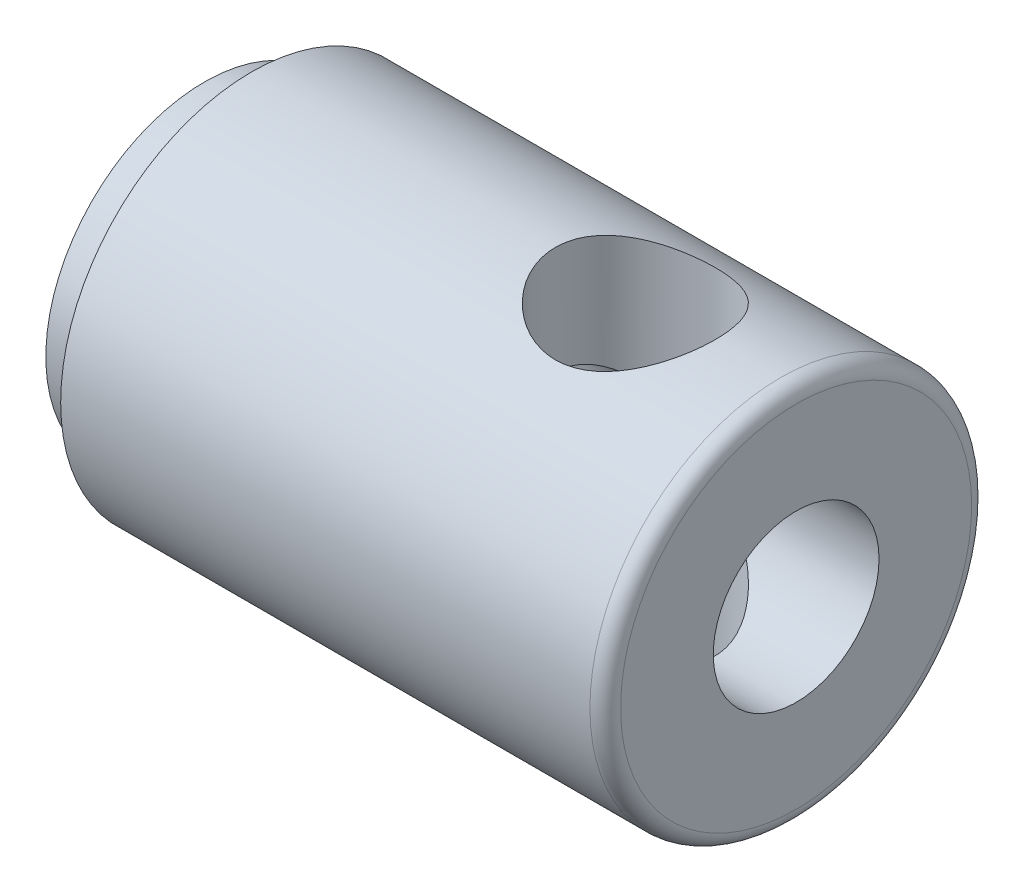
ISO-10303-21;
HEADER;
FILE_DESCRIPTION(('STEP AP214'),'2;1');
FILE_NAME('part.step','',(''),(''),'','','');
FILE_SCHEMA(('AUTOMOTIVE_DESIGN { 1 0 10303 214 1 1 1 1 }'));
ENDSEC;
DATA;
#1=APPLICATION_CONTEXT('core data for automotive mechanical design processes');
#2=APPLICATION_PROTOCOL_DEFINITION('international standard','automotive_design',2000,#1);
#3=PRODUCT_CONTEXT('',#1,'mechanical');
#4=PRODUCT('Part','Part','',(#3));
#5=PRODUCT_RELATED_PRODUCT_CATEGORY('part','',(#4));
#6=PRODUCT_DEFINITION_FORMATION('','',#4);
#7=PRODUCT_DEFINITION_CONTEXT('part definition',#1,'design');
#8=PRODUCT_DEFINITION('design','',#6,#7);
#9=PRODUCT_DEFINITION_SHAPE('','',#8);
#10=(LENGTH_UNIT() NAMED_UNIT(*) SI_UNIT(.MILLI.,.METRE.));
#11=(NAMED_UNIT(*) PLANE_ANGLE_UNIT() SI_UNIT($,.RADIAN.));
#12=(NAMED_UNIT(*) SI_UNIT($,.STERADIAN.) SOLID_ANGLE_UNIT());
#13=UNCERTAINTY_MEASURE_WITH_UNIT(LENGTH_MEASURE(1.E-05),#10,'distance_accuracy_value','');
#14=(GEOMETRIC_REPRESENTATION_CONTEXT(3) GLOBAL_UNCERTAINTY_ASSIGNED_CONTEXT((#13)) GLOBAL_UNIT_ASSIGNED_CONTEXT((#10,
#11,#12)) REPRESENTATION_CONTEXT('',''));
#15=CARTESIAN_POINT('',(0.,0.,0.));
#16=DIRECTION('',(0.,0.,1.));
#17=DIRECTION('',(1.,0.,0.));
#18=AXIS2_PLACEMENT_3D('',#15,#16,#17);
#19=CARTESIAN_POINT('',(0.,4.3561,0.));
#20=DIRECTION('',(1.,0.,0.));
#21=DIRECTION('',(0.,0.,-1.));
#22=AXIS2_PLACEMENT_3D('',#19,#20,#21);
#23=PLANE('',#22);
#24=CARTESIAN_POINT('',(0.,0.,0.));
#25=DIRECTION('',(1.,0.,0.));
#26=DIRECTION('',(0.,0.,-1.));
#27=AXIS2_PLACEMENT_3D('',#24,#25,#26);
#28=CIRCLE('',#27,4.3561);
#29=CARTESIAN_POINT('',(0.,0.,-4.3561));
#30=VERTEX_POINT('',#29);
#31=EDGE_CURVE('E10',#30,#30,#28,.T.);
#32=ORIENTED_EDGE('',*,*,#31,.T.);
#33=EDGE_LOOP('',(#32));
#34=FACE_BOUND('',#33,.T.);
#35=CARTESIAN_POINT('',(0.,0.,0.));
#36=DIRECTION('',(1.,0.,0.));
#37=DIRECTION('',(0.,0.,-1.));
#38=AXIS2_PLACEMENT_3D('',#35,#36,#37);
#39=CIRCLE('',#38,2.0574);
#40=CARTESIAN_POINT('',(0.,0.,-2.0574));
#41=VERTEX_POINT('',#40);
#42=EDGE_CURVE('E119',#41,#41,#39,.T.);
#43=ORIENTED_EDGE('',*,*,#42,.F.);
#44=EDGE_LOOP('',(#43));
#45=FACE_BOUND('',#44,.T.);
#46=ADVANCED_FACE('F43',(#34,#45),#23,.T.);
#47=CARTESIAN_POINT('',(-0.380999999999999,0.,0.));
#48=DIRECTION('',(1.,0.,0.));
#49=DIRECTION('',(0.,0.,-1.));
#50=AXIS2_PLACEMENT_3D('',#47,#48,#49);
#51=TOROIDAL_SURFACE('',#50,4.3561,0.381);
#52=CARTESIAN_POINT('',(-0.380999999999999,0.,0.));
#53=DIRECTION('',(1.,0.,0.));
#54=DIRECTION('',(0.,0.,-1.));
#55=AXIS2_PLACEMENT_3D('',#52,#53,#54);
#56=CIRCLE('',#55,4.7371);
#57=CARTESIAN_POINT('',(-0.380999999999999,0.,-4.7371));
#58=VERTEX_POINT('',#57);
#59=EDGE_CURVE('E56',#58,#58,#56,.T.);
#60=ORIENTED_EDGE('',*,*,#59,.T.);
#61=EDGE_LOOP('',(#60));
#62=FACE_BOUND('',#61,.T.);
#63=ORIENTED_EDGE('',*,*,#31,.F.);
#64=EDGE_LOOP('',(#63));
#65=FACE_BOUND('',#64,.T.);
#66=ADVANCED_FACE('F101',(#62,#65),#51,.T.);
#67=CARTESIAN_POINT('',(0.,0.,0.));
#68=DIRECTION('',(1.,0.,0.));
#69=DIRECTION('',(0.,0.,-1.));
#70=AXIS2_PLACEMENT_3D('',#67,#68,#69);
#71=CYLINDRICAL_SURFACE('',#70,4.7371);
#72=CARTESIAN_POINT('',(-2.0066,-4.7371,0.));
#73=CARTESIAN_POINT('',(-2.00661160930655,-4.73709125478059,0.106247260861239));
#74=CARTESIAN_POINT('',(-2.01518355279714,-4.73348416499933,0.21265909177387));
#75=CARTESIAN_POINT('',(-2.04916581464988,-4.71940342907634,0.422464590112043));
#76=CARTESIAN_POINT('',(-2.07461981235104,-4.70891197159733,0.52584970000397));
#77=CARTESIAN_POINT('',(-2.14125884574014,-4.68218926313095,0.726221934067821));
#78=CARTESIAN_POINT('',(-2.18239035768073,-4.66597755517342,0.823229524550649));
#79=CARTESIAN_POINT('',(-2.27899474465418,-4.62939044582282,1.00887291751177));
#80=CARTESIAN_POINT('',(-2.33446336138752,-4.60901628110743,1.09751119512623));
#81=CARTESIAN_POINT('',(-2.46113308629297,-4.564986722249,1.26852995049766));
#82=CARTESIAN_POINT('',(-2.53294339357725,-4.54122312358785,1.35043109909344));
#83=CARTESIAN_POINT('',(-2.68896964882029,-4.49355928051223,1.5014406658355));
#84=CARTESIAN_POINT('',(-2.77319215130155,-4.4696589703534,1.57054228113734));
#85=CARTESIAN_POINT('',(-2.95674098752606,-4.42309379765227,1.69739673665375));
#86=CARTESIAN_POINT('',(-3.05661099293889,-4.40054993683145,1.75441201123128));
#87=CARTESIAN_POINT('',(-3.2656046338983,-4.3609686091665,1.85062035898411));
#88=CARTESIAN_POINT('',(-3.37472341657942,-4.3439282769062,1.88982271081086));
#89=CARTESIAN_POINT('',(-3.5935996690114,-4.31845579563485,1.94730761308184));
#90=CARTESIAN_POINT('',(-3.70306904468612,-4.30964595839279,1.9665132356335));
#91=CARTESIAN_POINT('',(-3.92400383080319,-4.30054723453583,1.98633874819906));
#92=CARTESIAN_POINT('',(-4.03546808837937,-4.30025357590995,1.98696904683416));
#93=CARTESIAN_POINT('',(-4.24798805724617,-4.30790109579118,1.97032072962433));
#94=CARTESIAN_POINT('',(-4.34917997172679,-4.31520467605674,1.95442879652033));
#95=CARTESIAN_POINT('',(-4.54730088799393,-4.3361452645636,1.90751499783664));
#96=CARTESIAN_POINT('',(-4.64422905904986,-4.34978350109302,1.87649019793972));
#97=CARTESIAN_POINT('',(-4.83353235489245,-4.38216566493001,1.79958511299348));
#98=CARTESIAN_POINT('',(-4.92576576640808,-4.40101255048425,1.75340130149597));
#99=CARTESIAN_POINT('',(-5.10153483691478,-4.44166510713171,1.64770403045082));
#100=CARTESIAN_POINT('',(-5.18506702586956,-4.46347195072865,1.58818528253555));
#101=CARTESIAN_POINT('',(-5.3485802095059,-4.50985549397677,1.45153403554585));
#102=CARTESIAN_POINT('',(-5.42764679893275,-4.53450959547594,1.37333060057696));
#103=CARTESIAN_POINT('',(-5.57185166817883,-4.58223806068081,1.20453243148222));
#104=CARTESIAN_POINT('',(-5.63698661533413,-4.60531204550278,1.11393474093842));
#105=CARTESIAN_POINT('',(-5.75283991151571,-4.64796357128224,0.920115562219483));
#106=CARTESIAN_POINT('',(-5.80318249679104,-4.66744594031831,0.816646967733895));
#107=CARTESIAN_POINT('',(-5.88542526429613,-4.69998705122234,0.601684737062633));
#108=CARTESIAN_POINT('',(-5.91733575152518,-4.71304938178879,0.490195624266796));
#109=CARTESIAN_POINT('',(-5.95988577676257,-4.73060602099676,0.269995424217527));
#110=CARTESIAN_POINT('',(-5.97175222334585,-4.73559368433747,0.161560716845439));
#111=CARTESIAN_POINT('',(-5.97753986001933,-4.73801662463081,-0.0558565967882627));
#112=CARTESIAN_POINT('',(-5.97146627282221,-4.73545409959905,-0.164839034372809));
#113=CARTESIAN_POINT('',(-5.94242120200457,-4.72338409713674,-0.374487378763777));
#114=CARTESIAN_POINT('',(-5.92031466500505,-4.71423227614257,-0.475295929740284));
#115=CARTESIAN_POINT('',(-5.86103870617315,-4.69028552414768,-0.671661169183583));
#116=CARTESIAN_POINT('',(-5.82386738640097,-4.6754898821228,-0.767217194186541));
#117=CARTESIAN_POINT('',(-5.73430367873356,-4.64109987962919,-0.953721420199868));
#118=CARTESIAN_POINT('',(-5.68147378837115,-4.62137056555833,-1.04443382997515));
#119=CARTESIAN_POINT('',(-5.5625728586668,-4.57921439491308,-1.2160311743785));
#120=CARTESIAN_POINT('',(-5.49649626542444,-4.55678640845756,-1.29691196401165));
#121=CARTESIAN_POINT('',(-5.34739792688551,-4.50964563616822,-1.45268947864412));
#122=CARTESIAN_POINT('',(-5.26349719219016,-4.48488480082548,-1.52673254479709));
#123=CARTESIAN_POINT('',(-5.08407262638229,-4.43731482791591,-1.65993019816451));
#124=CARTESIAN_POINT('',(-4.98854605723684,-4.41450615227039,-1.71908126801836));
#125=CARTESIAN_POINT('',(-4.78653293505402,-4.3732580231023,-1.82149319386274));
#126=CARTESIAN_POINT('',(-4.67990421007429,-4.35488878206806,-1.86450398807495));
#127=CARTESIAN_POINT('',(-4.45990554912058,-4.32555638025964,-1.93159102924933));
#128=CARTESIAN_POINT('',(-4.34654133816948,-4.31458702501486,-1.95568311590745));
#129=CARTESIAN_POINT('',(-4.12577258071795,-4.3022492862214,-1.98266673264998));
#130=CARTESIAN_POINT('',(-4.01858860962601,-4.30020165518718,-1.98705893921768));
#131=CARTESIAN_POINT('',(-3.80507249251985,-4.30413123299974,-1.97853322198202));
#132=CARTESIAN_POINT('',(-3.69874021497094,-4.31010717768011,-1.965618025073));
#133=CARTESIAN_POINT('',(-3.49515960014723,-4.3287868918744,-1.92410919580803));
#134=CARTESIAN_POINT('',(-3.39771974559543,-4.34115719533304,-1.89629038177257));
#135=CARTESIAN_POINT('',(-3.2088705475342,-4.37096673602868,-1.82652605782695));
#136=CARTESIAN_POINT('',(-3.11746291098444,-4.38840740056235,-1.78457656963152));
#137=CARTESIAN_POINT('',(-2.93723651799527,-4.42770034992413,-1.68482086753256));
#138=CARTESIAN_POINT('',(-2.84890879745652,-4.44975567256979,-1.62620899858671));
#139=CARTESIAN_POINT('',(-2.68287290060859,-4.49523252066311,-1.49591397464265));
#140=CARTESIAN_POINT('',(-2.60516848683449,-4.51865452598983,-1.42422620933255));
#141=CARTESIAN_POINT('',(-2.45667111875323,-4.56630600317413,-1.26352228967393));
#142=CARTESIAN_POINT('',(-2.38681420203372,-4.59046710145693,-1.17361673262617));
#143=CARTESIAN_POINT('',(-2.26312706137712,-4.63513701399649,-0.982466367545817));
#144=CARTESIAN_POINT('',(-2.20930412906096,-4.65564416488426,-0.881216429251976));
#145=CARTESIAN_POINT('',(-2.12036085296443,-4.69040711670621,-0.671778724066094));
#146=CARTESIAN_POINT('',(-2.08495176572238,-4.70475877032584,-0.563729853840175));
#147=CARTESIAN_POINT('',(-2.03313935066048,-4.72598322999375,-0.342675957533886));
#148=CARTESIAN_POINT('',(-2.01667663086209,-4.73287940290908,-0.229687578005843));
#149=CARTESIAN_POINT('',(-2.00773160984369,-4.73662714790134,-0.0775260935893641));
#150=CARTESIAN_POINT('',(-2.00659576328543,-4.7371031914911,-0.0387740056871017));
#151=CARTESIAN_POINT('',(-2.0066,-4.7371,0.));
#152=B_SPLINE_CURVE_WITH_KNOTS('',3,(#72,#73,#74,#75,#76,#77,#78,#79,#80,#81,#82,#83,#84,#85,
#86,#87,#88,#89,#90,#91,#92,#93,#94,#95,#96,#97,#98,#99,#100,#101,#102,#103,#104,#105,#106,#107,
#108,#109,#110,#111,#112,#113,#114,#115,#116,#117,#118,#119,#120,#121,#122,#123,#124,#125,#126,
#127,#128,#129,#130,#131,#132,#133,#134,#135,#136,#137,#138,#139,#140,#141,#142,#143,#144,#145,
#146,#147,#148,#149,#150,#151),.UNSPECIFIED.,.T.,.F.,(4,2,2,2,2,2,2,2,2,2,2,2,2,2,2,2,2,2,2,2,2,
2,2,2,2,2,2,2,2,2,2,2,2,2,2,2,2,2,2,4),(0.,0.318630540876568,0.638088715006234,0.9564658742228,
1.27474857988441,1.60775853293965,1.94094497328752,2.29074276956359,2.64035814866329,
2.97300338421832,3.30546221957202,3.61210831553051,3.91881389492,4.23207905562966,
4.54546867160252,4.88565550623597,5.22592362802378,5.57420757178797,5.92229660836658,
6.24818339827492,6.57397532518984,6.88338706882837,7.19283780589374,7.51191437195652,
7.83112499701168,8.17338246228853,8.51572069013679,8.86316296625316,9.21031403509848,
9.5305144495432,9.85066442025425,10.1555892256822,10.4605999500933,10.7840601102239,
11.1076345374723,11.4551373043167,11.8027978612556,12.1448286374034,12.4857842894823,
12.6020657098585),.UNSPECIFIED.);
#153=CARTESIAN_POINT('',(-2.0066,-4.7371,0.));
#154=VERTEX_POINT('',#153);
#155=EDGE_CURVE('E91',#154,#154,#152,.T.);
#156=ORIENTED_EDGE('',*,*,#155,.F.);
#157=EDGE_LOOP('',(#156));
#158=FACE_BOUND('',#157,.T.);
#159=CARTESIAN_POINT('',(-3.990975,4.30143839539461,1.984375));
#160=CARTESIAN_POINT('',(-3.88518384630423,4.30144674027937,1.98436649386728));
#161=CARTESIAN_POINT('',(-3.77923576520416,4.30539671352122,1.97586365115065));
#162=CARTESIAN_POINT('',(-3.57039368035743,4.32068687089252,1.94219039717493));
#163=CARTESIAN_POINT('',(-3.46750871615802,4.33204702282263,1.91697494841338));
#164=CARTESIAN_POINT('',(-3.26820188042007,4.36062814858164,1.85103037509836));
#165=CARTESIAN_POINT('',(-3.17175535680556,4.37782502610378,1.81036495301292));
#166=CARTESIAN_POINT('',(-2.98708052127952,4.4161066430864,1.7148629058174));
#167=CARTESIAN_POINT('',(-2.89885033316167,4.43719049166134,1.66002952681904));
#168=CARTESIAN_POINT('',(-2.72750980025853,4.48235383015096,1.53405993410122));
#169=CARTESIAN_POINT('',(-2.64497875467585,4.50653560165759,1.46217207749989));
#170=CARTESIAN_POINT('',(-2.49271509423297,4.5543298163696,1.30571222520244));
#171=CARTESIAN_POINT('',(-2.4229874449768,4.57794203561178,1.22113533126487));
#172=CARTESIAN_POINT('',(-2.29534428089976,4.6231821456188,1.03713718297849));
#173=CARTESIAN_POINT('',(-2.238082118512,4.64467732365305,0.937227085009983));
#174=CARTESIAN_POINT('',(-2.1414289542753,4.68200779551305,0.728128838603218));
#175=CARTESIAN_POINT('',(-2.10202993834778,4.69784562675918,0.618944876925214));
#176=CARTESIAN_POINT('',(-2.04432584486323,4.72135126375348,0.400481794117923));
#177=CARTESIAN_POINT('',(-2.02502139730421,4.72940454687929,0.29150896979477));
#178=CARTESIAN_POINT('',(-2.00482367519441,4.7378348839669,0.0715932392759921));
#179=CARTESIAN_POINT('',(-2.00392284776599,4.73821508697332,-0.0393488400233797));
#180=CARTESIAN_POINT('',(-2.02003760865501,4.73148231835068,-0.252781409169014));
#181=CARTESIAN_POINT('',(-2.0359547234031,4.72482874778626,-0.355372054915526));
#182=CARTESIAN_POINT('',(-2.08336850163935,4.70540850698429,-0.556269848676241));
#183=CARTESIAN_POINT('',(-2.11486631426052,4.69264138585243,-0.654576680161611));
#184=CARTESIAN_POINT('',(-2.19291974199366,4.66198151394387,-0.845922729955456));
#185=CARTESIAN_POINT('',(-2.23969796091856,4.64401346650635,-0.93885858016617));
#186=CARTESIAN_POINT('',(-2.34676479439664,4.60470659137793,-1.11580512470258));
#187=CARTESIAN_POINT('',(-2.4070582001023,4.58336656911086,-1.19981263831379));
#188=CARTESIAN_POINT('',(-2.54443074530151,4.53766209811324,-1.3628687312172));
#189=CARTESIAN_POINT('',(-2.6223988760483,4.51319049138419,-1.44113939270352));
#190=CARTESIAN_POINT('',(-2.7904035707373,4.4651171574865,-1.58383290743365));
#191=CARTESIAN_POINT('',(-2.8804448697255,4.44151577627069,-1.64825030154173));
#192=CARTESIAN_POINT('',(-3.07384997756815,4.39708513841085,-1.76343614056588));
#193=CARTESIAN_POINT('',(-3.17755920313163,4.37637533106129,-1.81367465517912));
#194=CARTESIAN_POINT('',(-3.39306354696086,4.3414990438751,-1.89565574087138));
#195=CARTESIAN_POINT('',(-3.50485274505578,4.32732782833359,-1.92741170267772));
#196=CARTESIAN_POINT('',(-3.72554563299706,4.3083112988178,-1.96953636900954));
#197=CARTESIAN_POINT('',(-3.83416018978095,4.3029168712995,-1.98116754156061));
#198=CARTESIAN_POINT('',(-4.05189968517413,4.30049431160287,-1.98642387558804));
#199=CARTESIAN_POINT('',(-4.16102443050629,4.30346323280651,-1.98005537879781));
#200=CARTESIAN_POINT('',(-4.36920879903114,4.3168650271068,-1.95064558586238));
#201=CARTESIAN_POINT('',(-4.46846153166043,4.3268000635945,-1.92871523187215));
#202=CARTESIAN_POINT('',(-4.66179464788833,4.35237594365161,-1.8702806200746));
#203=CARTESIAN_POINT('',(-4.75587380789484,4.36801813038685,-1.8337729313311));
#204=CARTESIAN_POINT('',(-4.94066670449787,4.40405655445912,-1.7454971698119));
#205=CARTESIAN_POINT('',(-5.03106666006012,4.42462683217673,-1.6931455960004));
#206=CARTESIAN_POINT('',(-5.20223612406231,4.46795875494929,-1.57524654872524));
#207=CARTESIAN_POINT('',(-5.28300140810115,4.49072135339729,-1.50969332050356));
#208=CARTESIAN_POINT('',(-5.43954086684642,4.53813788922735,-1.36088203429535));
#209=CARTESIAN_POINT('',(-5.5143544059552,4.56279301957017,-1.27660981547341));
#210=CARTESIAN_POINT('',(-5.64895387128064,4.60947657768255,-1.0961388172583));
#211=CARTESIAN_POINT('',(-5.70873862419843,4.63150480029864,-0.999939107559612));
#212=CARTESIAN_POINT('',(-5.81154151206642,4.67060620616239,-0.797613805212374));
#213=CARTESIAN_POINT('',(-5.85450918175137,4.68766443673486,-0.691459504203106));
#214=CARTESIAN_POINT('',(-5.92166067268813,4.71476043127221,-0.472530307266075));
#215=CARTESIAN_POINT('',(-5.94585580676913,4.72480242304557,-0.359759442801319));
#216=CARTESIAN_POINT('',(-5.97333958367227,4.73624343472757,-0.139380050649083));
#217=CARTESIAN_POINT('',(-5.97798224590035,4.73820202481142,-0.0319683033187753));
#218=CARTESIAN_POINT('',(-5.96987834664955,4.73480889602918,0.182067391696659));
#219=CARTESIAN_POINT('',(-5.95713489185048,4.72945848318949,0.288691476704538));
#220=CARTESIAN_POINT('',(-5.91559261369874,4.71234418457988,0.494150246127802));
#221=CARTESIAN_POINT('',(-5.88739073605382,4.70081909411477,0.593127178098715));
#222=CARTESIAN_POINT('',(-5.81638742807539,4.67262712179173,0.784904636316013));
#223=CARTESIAN_POINT('',(-5.77358323993312,4.65595926872273,0.877703991898829));
#224=CARTESIAN_POINT('',(-5.67242440235022,4.61815418713709,1.05912396610333));
#225=CARTESIAN_POINT('',(-5.6134532520721,4.59684872444304,1.14736495991053));
#226=CARTESIAN_POINT('',(-5.48253025395327,4.55228750563062,1.31307644228668));
#227=CARTESIAN_POINT('',(-5.41057352486491,4.52903101789186,1.39054286126303));
#228=CARTESIAN_POINT('',(-5.2498678016823,4.48117321780906,1.53805962226132));
#229=CARTESIAN_POINT('',(-5.16030339077986,4.45658965682475,1.60723118551884));
#230=CARTESIAN_POINT('',(-4.97011011362509,4.41050595036014,1.72969571607758));
#231=CARTESIAN_POINT('',(-4.86947506418997,4.38900754360781,1.78297974758809));
#232=CARTESIAN_POINT('',(-4.66001489557343,4.35195167608454,1.87161972660312));
#233=CARTESIAN_POINT('',(-4.55123111679694,4.33636637616168,1.90705994830386));
#234=CARTESIAN_POINT('',(-4.38438800928867,4.31903464877838,1.94582628313315));
#235=CARTESIAN_POINT('',(-4.32821826010646,4.31426680169224,1.95634616807192));
#236=CARTESIAN_POINT('',(-4.21505058076511,4.30690295051556,1.97250833888586));
#237=CARTESIAN_POINT('',(-4.15805325857951,4.30430542674334,1.97815403780624));
#238=CARTESIAN_POINT('',(-4.06431273272718,4.30190640925637,1.98335984329755));
#239=CARTESIAN_POINT('',(-4.02765329803016,4.30143550218323,1.98437794911682));
#240=CARTESIAN_POINT('',(-3.990975,4.30143839539461,1.984375));
#241=B_SPLINE_CURVE_WITH_KNOTS('',3,(#159,#160,#161,#162,#163,#164,#165,#166,#167,#168,#169,
#170,#171,#172,#173,#174,#175,#176,#177,#178,#179,#180,#181,#182,#183,#184,#185,#186,#187,#188,
#189,#190,#191,#192,#193,#194,#195,#196,#197,#198,#199,#200,#201,#202,#203,#204,#205,#206,#207,
#208,#209,#210,#211,#212,#213,#214,#215,#216,#217,#218,#219,#220,#221,#222,#223,#224,#225,#226,
#227,#228,#229,#230,#231,#232,#233,#234,#235,#236,#237,#238,#239,#240),.UNSPECIFIED.,.T.,.F.,(4,
2,2,2,2,2,2,2,2,2,2,2,2,2,2,2,2,2,2,2,2,2,2,2,2,2,2,2,2,2,2,2,2,2,2,2,2,2,2,2,4),(0.,
0.317244224361905,0.635346860510381,0.952151902506158,1.26888442352607,1.60368755941788,
1.93862027065027,2.28826436924314,2.6377514487611,2.96887949584223,3.29987164466717,
3.61050738307491,3.92116603541232,4.23656878929481,4.55208353121696,4.89004372371305,
5.22813685260792,5.577563592528,5.92673685439038,6.25308296311795,6.57931410628895,
6.88433457140299,7.18942686879679,7.50750759554204,7.82572727875343,8.17018549624604,
8.51467059728082,8.86018165696662,9.20548434042991,9.52643592834899,9.84733017377848,
10.1566261582156,10.4659805890082,10.7893462044553,11.1128336264068,11.4586104350445,
11.8045813572814,12.1489026019505,12.3207325419448,12.4924420638589,12.6024321509597),.UNSPECIFIED.);
#242=CARTESIAN_POINT('',(-3.990975,4.30143839539461,1.984375));
#243=VERTEX_POINT('',#242);
#244=EDGE_CURVE('E84',#243,#243,#241,.T.);
#245=ORIENTED_EDGE('',*,*,#244,.F.);
#246=EDGE_LOOP('',(#245));
#247=FACE_BOUND('',#246,.T.);
#248=CARTESIAN_POINT('',(-13.515975,0.,0.));
#249=DIRECTION('',(1.,0.,0.));
#250=DIRECTION('',(0.,0.,-1.));
#251=AXIS2_PLACEMENT_3D('',#248,#249,#250);
#252=CIRCLE('',#251,4.7371);
#253=CARTESIAN_POINT('',(-13.515975,0.,-4.7371));
#254=VERTEX_POINT('',#253);
#255=EDGE_CURVE('E62',#254,#254,#252,.T.);
#256=ORIENTED_EDGE('',*,*,#255,.T.);
#257=EDGE_LOOP('',(#256));
#258=FACE_BOUND('',#257,.T.);
#259=ORIENTED_EDGE('',*,*,#59,.F.);
#260=EDGE_LOOP('',(#259));
#261=FACE_BOUND('',#260,.T.);
#262=ADVANCED_FACE('F96',(#158,#247,#258,#261),#71,.T.);
#263=CARTESIAN_POINT('',(-13.515975,3.937,0.));
#264=DIRECTION('',(-1.,0.,0.));
#265=DIRECTION('',(0.,0.,1.));
#266=AXIS2_PLACEMENT_3D('',#263,#264,#265);
#267=PLANE('',#266);
#268=CARTESIAN_POINT('',(-13.515975,0.,0.));
#269=DIRECTION('',(1.,0.,0.));
#270=DIRECTION('',(0.,0.,-1.));
#271=AXIS2_PLACEMENT_3D('',#268,#269,#270);
#272=CIRCLE('',#271,3.937);
#273=CARTESIAN_POINT('',(-13.515975,0.,-3.937));
#274=VERTEX_POINT('',#273);
#275=EDGE_CURVE('E137',#274,#274,#272,.T.);
#276=ORIENTED_EDGE('',*,*,#275,.T.);
#277=EDGE_LOOP('',(#276));
#278=FACE_BOUND('',#277,.T.);
#279=ORIENTED_EDGE('',*,*,#255,.F.);
#280=EDGE_LOOP('',(#279));
#281=FACE_BOUND('',#280,.T.);
#282=ADVANCED_FACE('F100',(#278,#281),#267,.T.);
#283=CARTESIAN_POINT('',(0.,0.,0.));
#284=DIRECTION('',(1.,0.,0.));
#285=DIRECTION('',(0.,0.,-1.));
#286=AXIS2_PLACEMENT_3D('',#283,#284,#285);
#287=CYLINDRICAL_SURFACE('',#286,3.937);
#288=CARTESIAN_POINT('',(-14.684375,0.,0.));
#289=DIRECTION('',(1.,0.,0.));
#290=DIRECTION('',(0.,0.,-1.));
#291=AXIS2_PLACEMENT_3D('',#288,#289,#290);
#292=CIRCLE('',#291,3.937);
#293=CARTESIAN_POINT('',(-14.684375,0.,-3.937));
#294=VERTEX_POINT('',#293);
#295=EDGE_CURVE('E133',#294,#294,#292,.T.);
#296=ORIENTED_EDGE('',*,*,#295,.T.);
#297=EDGE_LOOP('',(#296));
#298=FACE_BOUND('',#297,.T.);
#299=ORIENTED_EDGE('',*,*,#275,.F.);
#300=EDGE_LOOP('',(#299));
#301=FACE_BOUND('',#300,.T.);
#302=ADVANCED_FACE('F145',(#298,#301),#287,.T.);
#303=CARTESIAN_POINT('',(-14.684375,3.937,0.));
#304=DIRECTION('',(-1.,0.,0.));
#305=DIRECTION('',(0.,0.,1.));
#306=AXIS2_PLACEMENT_3D('',#303,#304,#305);
#307=PLANE('',#306);
#308=CARTESIAN_POINT('',(-14.684375,0.,0.));
#309=DIRECTION('',(1.,0.,0.));
#310=DIRECTION('',(0.,0.,-1.));
#311=AXIS2_PLACEMENT_3D('',#308,#309,#310);
#312=CIRCLE('',#311,3.81);
#313=CARTESIAN_POINT('',(-14.684375,0.,-3.81));
#314=VERTEX_POINT('',#313);
#315=EDGE_CURVE('E126',#314,#314,#312,.T.);
#316=ORIENTED_EDGE('',*,*,#315,.T.);
#317=EDGE_LOOP('',(#316));
#318=FACE_BOUND('',#317,.T.);
#319=ORIENTED_EDGE('',*,*,#295,.F.);
#320=EDGE_LOOP('',(#319));
#321=FACE_BOUND('',#320,.T.);
#322=ADVANCED_FACE('F150',(#318,#321),#307,.T.);
#323=CARTESIAN_POINT('',(-14.684375,0.,0.));
#324=DIRECTION('',(-1.,0.,0.));
#325=DIRECTION('',(0.,0.,1.));
#326=AXIS2_PLACEMENT_3D('',#323,#324,#325);
#327=CONICAL_SURFACE('',#326,3.81,0.785398163397443);
#328=CARTESIAN_POINT('',(-12.931775,0.,0.));
#329=DIRECTION('',(1.,0.,0.));
#330=DIRECTION('',(0.,0.,-1.));
#331=AXIS2_PLACEMENT_3D('',#328,#329,#330);
#332=CIRCLE('',#331,2.0574);
#333=CARTESIAN_POINT('',(-12.931775,0.,-2.0574));
#334=VERTEX_POINT('',#333);
#335=EDGE_CURVE('E122',#334,#334,#332,.T.);
#336=ORIENTED_EDGE('',*,*,#335,.T.);
#337=EDGE_LOOP('',(#336));
#338=FACE_BOUND('',#337,.T.);
#339=ORIENTED_EDGE('',*,*,#315,.F.);
#340=EDGE_LOOP('',(#339));
#341=FACE_BOUND('',#340,.T.);
#342=ADVANCED_FACE('F157',(#338,#341),#327,.F.);
#343=CARTESIAN_POINT('',(0.,0.,0.));
#344=DIRECTION('',(1.,0.,0.));
#345=DIRECTION('',(0.,0.,-1.));
#346=AXIS2_PLACEMENT_3D('',#343,#344,#345);
#347=CYLINDRICAL_SURFACE('',#346,2.0574);
#348=CARTESIAN_POINT('',(-3.990975,-0.543277663239523,1.984375));
#349=CARTESIAN_POINT('',(-3.95521652105274,-0.543283511093871,1.98437399410283));
#350=CARTESIAN_POINT('',(-3.91944875706258,-0.546895852634215,1.98339434093172));
#351=CARTESIAN_POINT('',(-3.84916129162295,-0.560405497387259,1.97961748377416));
#352=CARTESIAN_POINT('',(-3.81464765036617,-0.570329888437252,1.97681244503073));
#353=CARTESIAN_POINT('',(-3.72585266909286,-0.602296537612438,1.96737054495674));
#354=CARTESIAN_POINT('',(-3.67310429607437,-0.62802802659755,1.95942980312738));
#355=CARTESIAN_POINT('',(-3.5714161822768,-0.685137934569528,1.9402079160267));
#356=CARTESIAN_POINT('',(-3.52249421226305,-0.716540691198425,1.92891223316193));
#357=CARTESIAN_POINT('',(-3.41832047984978,-0.788292919069062,1.90085268109966));
#358=CARTESIAN_POINT('',(-3.36363269274373,-0.829208491903762,1.88345757767434));
#359=CARTESIAN_POINT('',(-3.25696051297761,-0.912599428235428,1.84450221734556));
#360=CARTESIAN_POINT('',(-3.20497876715972,-0.955076252047702,1.8229379761853));
#361=CARTESIAN_POINT('',(-3.10326555040385,-1.04039191061735,1.77562921808275));
#362=CARTESIAN_POINT('',(-3.05353383831606,-1.0832307059932,1.74988515048145));
#363=CARTESIAN_POINT('',(-2.95620011982528,-1.16848832345679,1.69414453168578));
#364=CARTESIAN_POINT('',(-2.90859724398254,-1.21090731138342,1.66414973779033));
#365=CARTESIAN_POINT('',(-2.77024771250957,-1.33555813893809,1.56845505998798));
#366=CARTESIAN_POINT('',(-2.68253011766518,-1.41641959599186,1.49638402760892));
#367=CARTESIAN_POINT('',(-2.51749840164778,-1.57016532319525,1.33414412274988));
#368=CARTESIAN_POINT('',(-2.44016574877872,-1.64306375859466,1.24400822305027));
#369=CARTESIAN_POINT('',(-2.31905387909703,-1.75789989881038,1.07247800991184));
#370=CARTESIAN_POINT('',(-2.27189554555678,-1.80283906753888,0.995495361300194));
#371=CARTESIAN_POINT('',(-2.1871546734942,-1.88381596650407,0.832113395562109));
#372=CARTESIAN_POINT('',(-2.14956017173034,-1.91986481575323,0.745726037819852));
#373=CARTESIAN_POINT('',(-2.09115261210465,-1.97596068830541,0.578787486342555));
#374=CARTESIAN_POINT('',(-2.06865008194825,-1.99761397049974,0.49937328765342));
#375=CARTESIAN_POINT('',(-2.03355380134302,-2.03140978327336,0.336417744526063));
#376=CARTESIAN_POINT('',(-2.02095424339172,-2.04355788805335,0.252878849574639));
#377=CARTESIAN_POINT('',(-2.00654483608315,-2.05745229967025,0.0837136905349586));
#378=CARTESIAN_POINT('',(-2.00477128138928,-2.05916361668915,-0.00191862981212508));
#379=CARTESIAN_POINT('',(-2.01225194343395,-2.05194898332862,-0.172242877047274));
#380=CARTESIAN_POINT('',(-2.02150703326012,-2.04302219077841,-0.256934728946974));
#381=CARTESIAN_POINT('',(-2.04958906015036,-2.01596545435264,-0.418503090166461));
#382=CARTESIAN_POINT('',(-2.06789554813459,-1.99833598809496,-0.495557204411013));
#383=CARTESIAN_POINT('',(-2.11269928222038,-1.95525776996039,-0.64491438417794));
#384=CARTESIAN_POINT('',(-2.13919959333895,-1.92980609209458,-0.717215659540089));
#385=CARTESIAN_POINT('',(-2.2105122628381,-1.8614660250817,-0.882358346751669));
#386=CARTESIAN_POINT('',(-2.25845976334109,-1.81562355417161,-0.972626490894256));
#387=CARTESIAN_POINT('',(-2.36453134312233,-1.7147032498551,-1.14122589036361));
#388=CARTESIAN_POINT('',(-2.42267626497686,-1.6596065115356,-1.21953207112056));
#389=CARTESIAN_POINT('',(-2.56925827301,-1.52170124836801,-1.39044562199295));
#390=CARTESIAN_POINT('',(-2.66103403146302,-1.43608893867321,-1.47794141438121));
#391=CARTESIAN_POINT('',(-2.80655033477877,-1.30293334690525,-1.59333757247218));
#392=CARTESIAN_POINT('',(-2.85642567665648,-1.25770455373541,-1.62919338830573));
#393=CARTESIAN_POINT('',(-2.95865537897191,-1.16632587031593,-1.69581120532342));
#394=CARTESIAN_POINT('',(-3.01100886151044,-1.12017630955722,-1.72657499328309));
#395=CARTESIAN_POINT('',(-3.13668859150627,-1.01171658300918,-1.7929344729715));
#396=CARTESIAN_POINT('',(-3.21101736202842,-0.94932572732079,-1.82653366419533));
#397=CARTESIAN_POINT('',(-3.32656599869264,-0.857937040809348,-1.87029036684322));
#398=CARTESIAN_POINT('',(-3.36571595744373,-0.827870086104336,-1.88375851353216));
#399=CARTESIAN_POINT('',(-3.44576174519192,-0.769192182564499,-1.90846657977674));
#400=CARTESIAN_POINT('',(-3.48665644642465,-0.740580318644294,-1.91970791295158));
#401=CARTESIAN_POINT('',(-3.56385804023731,-0.690554210923124,-1.93820024865507));
#402=CARTESIAN_POINT('',(-3.59981167568385,-0.668730535778231,-1.94580351082309));
#403=CARTESIAN_POINT('',(-3.67387290508756,-0.628282332628244,-1.95923639403231));
#404=CARTESIAN_POINT('',(-3.71198074305491,-0.609658168006071,-1.96506581366808));
#405=CARTESIAN_POINT('',(-3.78316100445213,-0.580944196056025,-1.97372257496128));
#406=CARTESIAN_POINT('',(-3.81579042726302,-0.569901640562567,-1.97691181469136));
#407=CARTESIAN_POINT('',(-3.88244426923788,-0.553084012071857,-1.98168417946788));
#408=CARTESIAN_POINT('',(-3.91646290722086,-0.547289053622273,-1.98327337038677));
#409=CARTESIAN_POINT('',(-3.98538624507733,-0.542214804971246,-1.98466821700858));
#410=CARTESIAN_POINT('',(-4.02029630549955,-0.542998302784235,-1.9844566854673));
#411=CARTESIAN_POINT('',(-4.08932962342274,-0.551032577942006,-1.98223910010906));
#412=CARTESIAN_POINT('',(-4.12345072849564,-0.558299298014891,-1.98022862251368));
#413=CARTESIAN_POINT('',(-4.20401334016754,-0.581785675334216,-1.97347819589733));
#414=CARTESIAN_POINT('',(-4.24962803318615,-0.600480636444832,-1.9679476415879));
#415=CARTESIAN_POINT('',(-4.33783112194999,-0.643401897155484,-1.95433936190288));
#416=CARTESIAN_POINT('',(-4.38040291558427,-0.667655892112815,-1.94624880296243));
#417=CARTESIAN_POINT('',(-4.48412805571688,-0.732083447194192,-1.92318155810586));
#418=CARTESIAN_POINT('',(-4.5437949348161,-0.774106344874337,-1.90679137368753));
#419=CARTESIAN_POINT('',(-4.65970780004398,-0.860761756008571,-1.86928932386864));
#420=CARTESIAN_POINT('',(-4.71594728432607,-0.905398932521138,-1.84816881915757));
#421=CARTESIAN_POINT('',(-4.82588022116851,-0.995606149283392,-1.80118163429168));
#422=CARTESIAN_POINT('',(-4.87956730730757,-1.04117815391014,-1.775303797189));
#423=CARTESIAN_POINT('',(-4.98450359755936,-1.13206402466667,-1.71877655031732));
#424=CARTESIAN_POINT('',(-5.0357546667587,-1.17737806411659,-1.68813087035589));
#425=CARTESIAN_POINT('',(-5.1382118134276,-1.26915780070504,-1.62035032788299));
#426=CARTESIAN_POINT('',(-5.18930373091096,-1.3155782729766,-1.5829790410218));
#427=CARTESIAN_POINT('',(-5.28860628724423,-1.40663018598036,-1.5026586819207));
#428=CARTESIAN_POINT('',(-5.33681578316631,-1.45126091477001,-1.45970741826628));
#429=CARTESIAN_POINT('',(-5.4761524013388,-1.58106006556598,-1.32246531094446));
#430=CARTESIAN_POINT('',(-5.56253870251064,-1.66263721410061,-1.21943143894059));
#431=CARTESIAN_POINT('',(-5.68755071907733,-1.78137790212373,-1.03288179593723));
#432=CARTESIAN_POINT('',(-5.73195274726957,-1.82373871145809,-0.956487693772735));
#433=CARTESIAN_POINT('',(-5.81141489462985,-1.89974059003062,-0.794877762167586));
#434=CARTESIAN_POINT('',(-5.84647884730965,-1.9333852373147,-0.709665572781697));
#435=CARTESIAN_POINT('',(-5.90532740320383,-1.9899320629333,-0.530963709429971));
#436=CARTESIAN_POINT('',(-5.92899955614206,-2.01272712007165,-0.437401904754471));
#437=CARTESIAN_POINT('',(-5.96248529653115,-2.0449896328528,-0.245616313013161));
#438=CARTESIAN_POINT('',(-5.97231528637982,-2.05447286242546,-0.147398186462668));
#439=CARTESIAN_POINT('',(-5.97683744381692,-2.05883477825669,0.0357449311401684));
#440=CARTESIAN_POINT('',(-5.97347316621884,-2.05558856063137,0.120586262528429));
#441=CARTESIAN_POINT('',(-5.95612497565127,-2.03886235854396,0.28813211329444));
#442=CARTESIAN_POINT('',(-5.94214072083823,-2.02538204465932,0.370836563800101));
#443=CARTESIAN_POINT('',(-5.90517678855623,-1.9897977062881,0.529117696803865));
#444=CARTESIAN_POINT('',(-5.88251812800694,-1.96800151849775,0.604840966046399));
#445=CARTESIAN_POINT('',(-5.82945423495311,-1.91705566329339,0.750854331701187));
#446=CARTESIAN_POINT('',(-5.79904666450716,-1.88790377660079,0.821142780004089));
#447=CARTESIAN_POINT('',(-5.71668996525104,-1.80915282693812,0.985637610541048));
#448=CARTESIAN_POINT('',(-5.66118822092957,-1.75623943654255,1.07648584087689));
#449=CARTESIAN_POINT('',(-5.53993685940245,-1.64136129499654,1.24469674767648));
#450=CARTESIAN_POINT('',(-5.474159585497,-1.57937214546911,1.32202179980839));
#451=CARTESIAN_POINT('',(-5.30949628226891,-1.42563007795516,1.48915906246059));
#452=CARTESIAN_POINT('',(-5.20726865846381,-1.33125102064212,1.57328686669777));
#453=CARTESIAN_POINT('',(-5.04582960792977,-1.18630933811941,1.68203040745522));
#454=CARTESIAN_POINT('',(-4.99065892339254,-1.13742637415439,1.71537357892514));
#455=CARTESIAN_POINT('',(-4.87754151347245,-1.03939314208687,1.77647920268845));
#456=CARTESIAN_POINT('',(-4.81959632157612,-0.99024303465459,1.80424469469653));
#457=CARTESIAN_POINT('',(-4.70900107241773,-0.899914626015626,1.85074396370955));
#458=CARTESIAN_POINT('',(-4.65676674954859,-0.858594981727665,1.87020030230801));
#459=CARTESIAN_POINT('',(-4.54923943708711,-0.778144463963294,1.90506962433982));
#460=CARTESIAN_POINT('',(-4.49394577876563,-0.739014072817231,1.92048171949489));
#461=CARTESIAN_POINT('',(-4.39558807929058,-0.676662085545904,1.94313860020495));
#462=CARTESIAN_POINT('',(-4.35362391604374,-0.652116529644181,1.95145589294232));
#463=CARTESIAN_POINT('',(-4.26668670882015,-0.608084546808563,1.96561856640474));
#464=CARTESIAN_POINT('',(-4.22172280716759,-0.588583558634609,1.97147109314564));
#465=CARTESIAN_POINT('',(-4.14540262188241,-0.564106812796024,1.97858078724813));
#466=CARTESIAN_POINT('',(-4.11502990292484,-0.55642805550759,1.98073485714312));
#467=CARTESIAN_POINT('',(-4.05343019972834,-0.546018525720989,1.9836302329959));
#468=CARTESIAN_POINT('',(-4.02220614123621,-0.543272555774932,1.98437587854175));
#469=CARTESIAN_POINT('',(-3.990975,-0.543277663239523,1.984375));
#470=B_SPLINE_CURVE_WITH_KNOTS('',3,(#348,#349,#350,#351,#352,#353,#354,#355,#356,#357,#358,
#359,#360,#361,#362,#363,#364,#365,#366,#367,#368,#369,#370,#371,#372,#373,#374,#375,#376,#377,
#378,#379,#380,#381,#382,#383,#384,#385,#386,#387,#388,#389,#390,#391,#392,#393,#394,#395,#396,
#397,#398,#399,#400,#401,#402,#403,#404,#405,#406,#407,#408,#409,#410,#411,#412,#413,#414,#415,
#416,#417,#418,#419,#420,#421,#422,#423,#424,#425,#426,#427,#428,#429,#430,#431,#432,#433,#434,
#435,#436,#437,#438,#439,#440,#441,#442,#443,#444,#445,#446,#447,#448,#449,#450,#451,#452,#453,
#454,#455,#456,#457,#458,#459,#460,#461,#462,#463,#464,#465,#466,#467,#468,#469),.UNSPECIFIED.,
.T.,.F.,(4,2,2,2,2,2,2,2,2,2,2,2,2,2,2,2,2,2,2,2,2,2,2,2,2,2,2,2,2,2,2,2,2,2,2,2,2,2,2,2,2,2,2,
2,2,2,2,2,2,2,2,2,2,2,2,2,2,2,2,2,4),(0.,0.107134648541738,0.214732191021988,0.391400995980602,
0.568846795321466,0.780015294693846,0.99138660479507,1.20273520702017,1.41399668882764,
1.83056317663561,2.24637614248807,2.54784997658957,2.84894482685239,3.10385998383521,
3.35862553651167,3.61424473515209,3.86988417134681,4.11228649131399,4.35477959526606,
4.68898300210995,5.02387762415306,5.48021756388314,5.70890763241731,5.93751728346683,
6.24502301900977,6.39846189381464,6.55180304863319,6.67989658377198,6.80800465747031,
6.91144947635158,7.01450063669091,7.11853647786574,7.22282885824781,7.37081158290047,
7.51954823771463,7.7434777250128,7.96781957443134,8.19269442474618,8.41739423547473,
8.65260081582095,8.88790004926434,9.35605208246057,9.64903822176213,9.94190389692355,
10.2376040366184,10.5329534880239,10.7865499152674,11.0401545058033,11.2851618689374,
11.5302432415069,11.8849087483619,12.2405458322996,12.7255086695397,12.9680561607603,
13.2104711080888,13.4184797179169,13.6265339766209,13.7742916321498,13.9216178993865,
14.0154780331702,14.109048493615),.UNSPECIFIED.);
#471=CARTESIAN_POINT('',(-3.990975,-0.543277663239523,1.984375));
#472=VERTEX_POINT('',#471);
#473=EDGE_CURVE('E46',#472,#472,#470,.T.);
#474=ORIENTED_EDGE('',*,*,#473,.F.);
#475=EDGE_LOOP('',(#474));
#476=FACE_BOUND('',#475,.T.);
#477=CARTESIAN_POINT('',(-3.990975,0.543277663239523,1.984375));
#478=CARTESIAN_POINT('',(-4.02673347894725,0.543283511093871,1.98437399410283));
#479=CARTESIAN_POINT('',(-4.06250124293741,0.546895852634215,1.98339434093172));
#480=CARTESIAN_POINT('',(-4.13278870837705,0.560405497387259,1.97961748377416));
#481=CARTESIAN_POINT('',(-4.16730234963383,0.570329888437252,1.97681244503073));
#482=CARTESIAN_POINT('',(-4.25609733090714,0.602296537612438,1.96737054495674));
#483=CARTESIAN_POINT('',(-4.30884570392563,0.62802802659755,1.95942980312738));
#484=CARTESIAN_POINT('',(-4.4105338177232,0.685137934569529,1.9402079160267));
#485=CARTESIAN_POINT('',(-4.45945578773695,0.716540691198426,1.92891223316193));
#486=CARTESIAN_POINT('',(-4.56362952015022,0.788292919069062,1.90085268109966));
#487=CARTESIAN_POINT('',(-4.61831730725627,0.829208491903763,1.88345757767434));
#488=CARTESIAN_POINT('',(-4.72498948702239,0.912599428235428,1.84450221734556));
#489=CARTESIAN_POINT('',(-4.77697123284028,0.955076252047703,1.8229379761853));
#490=CARTESIAN_POINT('',(-4.87868444959615,1.04039191061735,1.77562921808275));
#491=CARTESIAN_POINT('',(-4.92841616168394,1.0832307059932,1.74988515048145));
#492=CARTESIAN_POINT('',(-5.02574988017472,1.16848832345679,1.69414453168578));
#493=CARTESIAN_POINT('',(-5.07335275601746,1.21090731138342,1.66414973779033));
#494=CARTESIAN_POINT('',(-5.21170228749043,1.3355581389381,1.56845505998798));
#495=CARTESIAN_POINT('',(-5.29941988233482,1.41641959599186,1.49638402760892));
#496=CARTESIAN_POINT('',(-5.46445159835222,1.57016532319525,1.33414412274987));
#497=CARTESIAN_POINT('',(-5.54178425122128,1.64306375859466,1.24400822305026));
#498=CARTESIAN_POINT('',(-5.66289612090297,1.75789989881038,1.07247800991183));
#499=CARTESIAN_POINT('',(-5.71005445444322,1.80283906753888,0.995495361300192));
#500=CARTESIAN_POINT('',(-5.7947953265058,1.88381596650407,0.832113395562106));
#501=CARTESIAN_POINT('',(-5.83238982826966,1.91986481575323,0.74572603781985));
#502=CARTESIAN_POINT('',(-5.89079738789535,1.97596068830541,0.578787486342553));
#503=CARTESIAN_POINT('',(-5.91329991805175,1.99761397049974,0.499373287653418));
#504=CARTESIAN_POINT('',(-5.94839619865698,2.03140978327336,0.336417744526061));
#505=CARTESIAN_POINT('',(-5.96099575660828,2.04355788805335,0.252878849574637));
#506=CARTESIAN_POINT('',(-5.97540516391685,2.05745229967025,0.0837136905349568));
#507=CARTESIAN_POINT('',(-5.97717871861071,2.05916361668915,-0.00191862981212689));
#508=CARTESIAN_POINT('',(-5.96969805656605,2.05194898332862,-0.172242877047275));
#509=CARTESIAN_POINT('',(-5.96044296673988,2.04302219077841,-0.256934728946975));
#510=CARTESIAN_POINT('',(-5.93236093984964,2.01596545435264,-0.418503090166462));
#511=CARTESIAN_POINT('',(-5.91405445186541,1.99833598809496,-0.495557204411014));
#512=CARTESIAN_POINT('',(-5.86925071777962,1.95525776996039,-0.644914384177941));
#513=CARTESIAN_POINT('',(-5.84275040666105,1.92980609209458,-0.71721565954009));
#514=CARTESIAN_POINT('',(-5.7714377371619,1.8614660250817,-0.882358346751671));
#515=CARTESIAN_POINT('',(-5.72349023665891,1.81562355417161,-0.972626490894258));
#516=CARTESIAN_POINT('',(-5.61741865687767,1.7147032498551,-1.14122589036362));
#517=CARTESIAN_POINT('',(-5.55927373502314,1.6596065115356,-1.21953207112056));
#518=CARTESIAN_POINT('',(-5.41269172699,1.52170124836801,-1.39044562199295));
#519=CARTESIAN_POINT('',(-5.32091596853697,1.43608893867321,-1.47794141438121));
#520=CARTESIAN_POINT('',(-5.17539966522123,1.30293334690525,-1.59333757247218));
#521=CARTESIAN_POINT('',(-5.12552432334352,1.25770455373541,-1.62919338830573));
#522=CARTESIAN_POINT('',(-5.02329462102809,1.16632587031593,-1.69581120532342));
#523=CARTESIAN_POINT('',(-4.97094113848956,1.12017630955722,-1.72657499328309));
#524=CARTESIAN_POINT('',(-4.84526140849372,1.01171658300918,-1.7929344729715));
#525=CARTESIAN_POINT('',(-4.77093263797158,0.949325727320791,-1.82653366419533));
#526=CARTESIAN_POINT('',(-4.65538400130736,0.857937040809349,-1.87029036684322));
#527=CARTESIAN_POINT('',(-4.61623404255627,0.827870086104336,-1.88375851353216));
#528=CARTESIAN_POINT('',(-4.53618825480808,0.769192182564499,-1.90846657977673));
#529=CARTESIAN_POINT('',(-4.49529355357535,0.740580318644295,-1.91970791295158));
#530=CARTESIAN_POINT('',(-4.41809195976269,0.690554210923126,-1.93820024865506));
#531=CARTESIAN_POINT('',(-4.38213832431615,0.668730535778233,-1.94580351082309));
#532=CARTESIAN_POINT('',(-4.30807709491244,0.628282332628246,-1.95923639403231));
#533=CARTESIAN_POINT('',(-4.26996925694509,0.609658168006073,-1.96506581366808));
#534=CARTESIAN_POINT('',(-4.19878899554787,0.580944196056027,-1.97372257496128));
#535=CARTESIAN_POINT('',(-4.16615957273698,0.569901640562568,-1.97691181469136));
#536=CARTESIAN_POINT('',(-4.09950573076211,0.553084012071857,-1.98168417946788));
#537=CARTESIAN_POINT('',(-4.06548709277914,0.547289053622272,-1.98327337038677));
#538=CARTESIAN_POINT('',(-3.99656375492267,0.542214804971246,-1.98466821700858));
#539=CARTESIAN_POINT('',(-3.96165369450045,0.542998302784235,-1.9844566854673));
#540=CARTESIAN_POINT('',(-3.89262037657726,0.551032577942007,-1.98223910010906));
#541=CARTESIAN_POINT('',(-3.85849927150435,0.558299298014892,-1.98022862251368));
#542=CARTESIAN_POINT('',(-3.77793665983245,0.581785675334217,-1.97347819589733));
#543=CARTESIAN_POINT('',(-3.73232196681385,0.600480636444832,-1.9679476415879));
#544=CARTESIAN_POINT('',(-3.64411887805,0.643401897155485,-1.95433936190288));
#545=CARTESIAN_POINT('',(-3.60154708441573,0.667655892112816,-1.94624880296242));
#546=CARTESIAN_POINT('',(-3.49782194428311,0.732083447194194,-1.92318155810586));
#547=CARTESIAN_POINT('',(-3.43815506518389,0.77410634487434,-1.90679137368753));
#548=CARTESIAN_POINT('',(-3.32224219995602,0.860761756008574,-1.86928932386864));
#549=CARTESIAN_POINT('',(-3.26600271567392,0.905398932521142,-1.84816881915757));
#550=CARTESIAN_POINT('',(-3.15606977883149,0.995606149283396,-1.80118163429168));
#551=CARTESIAN_POINT('',(-3.10238269269242,1.04117815391015,-1.775303797189));
#552=CARTESIAN_POINT('',(-2.99744640244064,1.13206402466668,-1.71877655031731));
#553=CARTESIAN_POINT('',(-2.94619533324129,1.17737806411659,-1.68813087035589));
#554=CARTESIAN_POINT('',(-2.84373818657239,1.26915780070505,-1.62035032788298));
#555=CARTESIAN_POINT('',(-2.79264626908903,1.31557827297661,-1.58297904102179));
#556=CARTESIAN_POINT('',(-2.69334371275576,1.40663018598037,-1.50265868192069));
#557=CARTESIAN_POINT('',(-2.64513421683368,1.45126091477002,-1.45970741826628));
#558=CARTESIAN_POINT('',(-2.50579759866119,1.58106006556599,-1.32246531094445));
#559=CARTESIAN_POINT('',(-2.41941129748935,1.66263721410062,-1.21943143894059));
#560=CARTESIAN_POINT('',(-2.29439928092266,1.78137790212374,-1.03288179593722));
#561=CARTESIAN_POINT('',(-2.24999725273043,1.8237387114581,-0.956487693772723));
#562=CARTESIAN_POINT('',(-2.17053510537014,1.89974059003062,-0.794877762167575));
#563=CARTESIAN_POINT('',(-2.13547115269035,1.93338523731471,-0.709665572781686));
#564=CARTESIAN_POINT('',(-2.07662259679617,1.9899320629333,-0.53096370942996));
#565=CARTESIAN_POINT('',(-2.05295044385793,2.01272712007165,-0.43740190475446));
#566=CARTESIAN_POINT('',(-2.01946470346885,2.04498963285281,-0.245616313013151));
#567=CARTESIAN_POINT('',(-2.00963471362017,2.05447286242546,-0.147398186462658));
#568=CARTESIAN_POINT('',(-2.00511255618307,2.05883477825669,0.0357449311401769));
#569=CARTESIAN_POINT('',(-2.00847683378116,2.05558856063137,0.120586262528437));
#570=CARTESIAN_POINT('',(-2.02582502434873,2.03886235854396,0.288132113294448));
#571=CARTESIAN_POINT('',(-2.03980927916177,2.02538204465931,0.370836563800109));
#572=CARTESIAN_POINT('',(-2.07677321144377,1.9897977062881,0.529117696803872));
#573=CARTESIAN_POINT('',(-2.09943187199306,1.96800151849774,0.604840966046406));
#574=CARTESIAN_POINT('',(-2.15249576504689,1.91705566329339,0.750854331701193));
#575=CARTESIAN_POINT('',(-2.18290333549284,1.88790377660079,0.821142780004096));
#576=CARTESIAN_POINT('',(-2.26526003474896,1.80915282693812,0.985637610541055));
#577=CARTESIAN_POINT('',(-2.32076177907043,1.75623943654255,1.07648584087689));
#578=CARTESIAN_POINT('',(-2.44201314059755,1.64136129499653,1.24469674767648));
#579=CARTESIAN_POINT('',(-2.507790414503,1.5793721454691,1.3220217998084));
#580=CARTESIAN_POINT('',(-2.67245371773109,1.42563007795515,1.4891590624606));
#581=CARTESIAN_POINT('',(-2.7746813415362,1.33125102064211,1.57328686669777));
#582=CARTESIAN_POINT('',(-2.93612039207023,1.18630933811941,1.68203040745522));
#583=CARTESIAN_POINT('',(-2.99129107660747,1.13742637415438,1.71537357892515));
#584=CARTESIAN_POINT('',(-3.10440848652756,1.03939314208687,1.77647920268846));
#585=CARTESIAN_POINT('',(-3.16235367842388,0.990243034654584,1.80424469469653));
#586=CARTESIAN_POINT('',(-3.27294892758228,0.89991462601562,1.85074396370955));
#587=CARTESIAN_POINT('',(-3.32518325045141,0.858594981727659,1.87020030230801));
#588=CARTESIAN_POINT('',(-3.4327105629129,0.77814446396329,1.90506962433982));
#589=CARTESIAN_POINT('',(-3.48800422123438,0.739014072817228,1.92048171949489));
#590=CARTESIAN_POINT('',(-3.58636192070943,0.676662085545901,1.94313860020495));
#591=CARTESIAN_POINT('',(-3.62832608395626,0.652116529644177,1.95145589294232));
#592=CARTESIAN_POINT('',(-3.71526329117985,0.608084546808559,1.96561856640474));
#593=CARTESIAN_POINT('',(-3.76022719283242,0.588583558634607,1.97147109314564));
#594=CARTESIAN_POINT('',(-3.83654737811759,0.564106812796023,1.97858078724813));
#595=CARTESIAN_POINT('',(-3.86692009707516,0.556428055507589,1.98073485714312));
#596=CARTESIAN_POINT('',(-3.92851980027166,0.546018525720989,1.9836302329959));
#597=CARTESIAN_POINT('',(-3.95974385876379,0.543272555774932,1.98437587854175));
#598=CARTESIAN_POINT('',(-3.990975,0.543277663239523,1.984375));
#599=B_SPLINE_CURVE_WITH_KNOTS('',3,(#477,#478,#479,#480,#481,#482,#483,#484,#485,#486,#487,
#488,#489,#490,#491,#492,#493,#494,#495,#496,#497,#498,#499,#500,#501,#502,#503,#504,#505,#506,
#507,#508,#509,#510,#511,#512,#513,#514,#515,#516,#517,#518,#519,#520,#521,#522,#523,#524,#525,
#526,#527,#528,#529,#530,#531,#532,#533,#534,#535,#536,#537,#538,#539,#540,#541,#542,#543,#544,
#545,#546,#547,#548,#549,#550,#551,#552,#553,#554,#555,#556,#557,#558,#559,#560,#561,#562,#563,
#564,#565,#566,#567,#568,#569,#570,#571,#572,#573,#574,#575,#576,#577,#578,#579,#580,#581,#582,
#583,#584,#585,#586,#587,#588,#589,#590,#591,#592,#593,#594,#595,#596,#597,#598),.UNSPECIFIED.,
.T.,.F.,(4,2,2,2,2,2,2,2,2,2,2,2,2,2,2,2,2,2,2,2,2,2,2,2,2,2,2,2,2,2,2,2,2,2,2,2,2,2,2,2,2,2,2,
2,2,2,2,2,2,2,2,2,2,2,2,2,2,2,2,2,4),(0.,0.107134648541738,0.214732191021988,0.391400995980602,
0.568846795321466,0.780015294693846,0.991386604795072,1.20273520702017,1.41399668882764,
1.83056317663561,2.24637614248807,2.54784997658957,2.8489448268524,3.10385998383521,
3.35862553651167,3.61424473515209,3.86988417134681,4.112286491314,4.35477959526606,
4.68898300210995,5.02387762415306,5.48021756388314,5.70890763241731,5.93751728346683,
6.24502301900977,6.39846189381463,6.55180304863319,6.67989658377197,6.80800465747031,
6.91144947635158,7.01450063669091,7.11853647786574,7.22282885824781,7.37081158290047,
7.51954823771463,7.74347772501281,7.96781957443135,8.19269442474619,8.41739423547474,
8.65260081582096,8.88790004926435,9.35605208246059,9.64903822176215,9.94190389692356,
10.2376040366184,10.5329534880239,10.7865499152674,11.0401545058033,11.2851618689374,
11.5302432415069,11.8849087483619,12.2405458322996,12.7255086695397,12.9680561607603,
13.2104711080888,13.418479717917,13.626533976621,13.7742916321498,13.9216178993865,
14.0154780331702,14.109048493615),.UNSPECIFIED.);
#600=CARTESIAN_POINT('',(-3.990975,0.543277663239523,1.984375));
#601=VERTEX_POINT('',#600);
#602=EDGE_CURVE('E65',#601,#601,#599,.T.);
#603=ORIENTED_EDGE('',*,*,#602,.F.);
#604=EDGE_LOOP('',(#603));
#605=FACE_BOUND('',#604,.T.);
#606=ORIENTED_EDGE('',*,*,#42,.T.);
#607=EDGE_LOOP('',(#606));
#608=FACE_BOUND('',#607,.T.);
#609=ORIENTED_EDGE('',*,*,#335,.F.);
#610=EDGE_LOOP('',(#609));
#611=FACE_BOUND('',#610,.T.);
#612=ADVANCED_FACE('F71',(#476,#605,#608,#611),#347,.F.);
#613=CARTESIAN_POINT('',(-3.990975,-4.7371,0.));
#614=DIRECTION('',(0.,1.,0.));
#615=DIRECTION('',(0.,0.,1.));
#616=AXIS2_PLACEMENT_3D('',#613,#614,#615);
#617=CYLINDRICAL_SURFACE('',#616,1.984375);
#618=ORIENTED_EDGE('',*,*,#244,.T.);
#619=EDGE_LOOP('',(#618));
#620=FACE_BOUND('',#619,.T.);
#621=ORIENTED_EDGE('',*,*,#602,.T.);
#622=EDGE_LOOP('',(#621));
#623=FACE_BOUND('',#622,.T.);
#624=ADVANCED_FACE('F74',(#620,#623),#617,.F.);
#625=ORIENTED_EDGE('',*,*,#155,.T.);
#626=EDGE_LOOP('',(#625));
#627=FACE_BOUND('',#626,.T.);
#628=ORIENTED_EDGE('',*,*,#473,.T.);
#629=EDGE_LOOP('',(#628));
#630=FACE_BOUND('',#629,.T.);
#631=ADVANCED_FACE('F77',(#627,#630),#617,.F.);
#632=CLOSED_SHELL('',(#46,#66,#262,#282,#302,#322,#342,#612,#624,#631));
#633=MANIFOLD_SOLID_BREP('B2',#632);
#634=ADVANCED_BREP_SHAPE_REPRESENTATION('',(#18,#633),#14);
#635=SHAPE_DEFINITION_REPRESENTATION(#9,#634);
ENDSEC;
END-ISO-10303-21;
